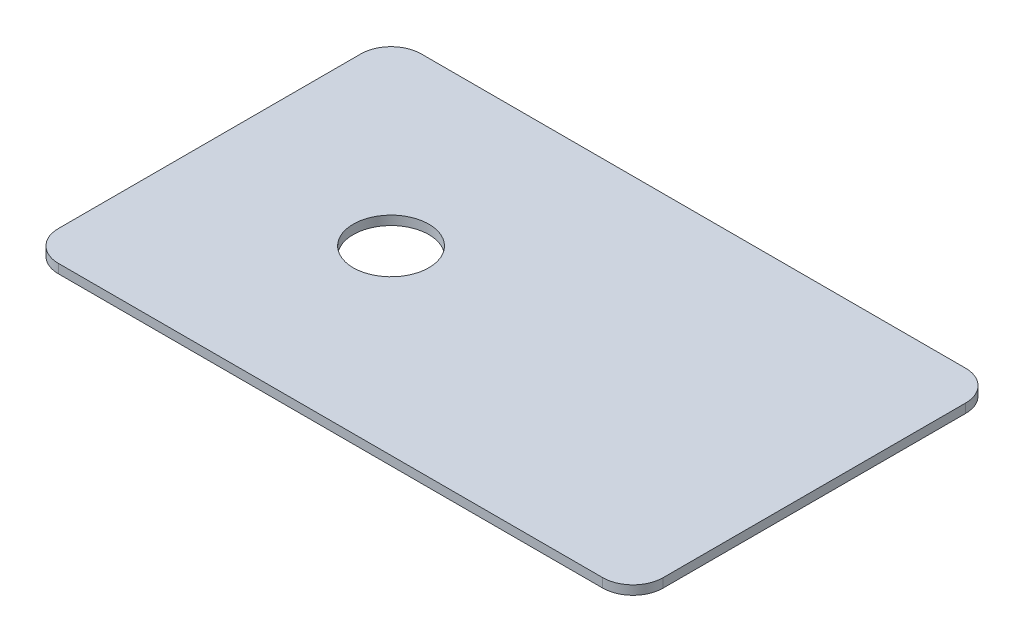
ISO-10303-21;
HEADER;
FILE_DESCRIPTION(('STEP AP214'),'2;1');
FILE_NAME('part.step','',(''),(''),'','','');
FILE_SCHEMA(('AUTOMOTIVE_DESIGN { 1 0 10303 214 1 1 1 1 }'));
ENDSEC;
DATA;
#1=APPLICATION_CONTEXT('core data for automotive mechanical design processes');
#2=APPLICATION_PROTOCOL_DEFINITION('international standard','automotive_design',2000,#1);
#3=PRODUCT_CONTEXT('',#1,'mechanical');
#4=PRODUCT('Part','Part','',(#3));
#5=PRODUCT_RELATED_PRODUCT_CATEGORY('part','',(#4));
#6=PRODUCT_DEFINITION_FORMATION('','',#4);
#7=PRODUCT_DEFINITION_CONTEXT('part definition',#1,'design');
#8=PRODUCT_DEFINITION('design','',#6,#7);
#9=PRODUCT_DEFINITION_SHAPE('','',#8);
#10=(LENGTH_UNIT() NAMED_UNIT(*) SI_UNIT(.MILLI.,.METRE.));
#11=(NAMED_UNIT(*) PLANE_ANGLE_UNIT() SI_UNIT($,.RADIAN.));
#12=(NAMED_UNIT(*) SI_UNIT($,.STERADIAN.) SOLID_ANGLE_UNIT());
#13=UNCERTAINTY_MEASURE_WITH_UNIT(LENGTH_MEASURE(1.E-05),#10,'distance_accuracy_value','');
#14=(GEOMETRIC_REPRESENTATION_CONTEXT(3) GLOBAL_UNCERTAINTY_ASSIGNED_CONTEXT((#13)) GLOBAL_UNIT_ASSIGNED_CONTEXT((#10,
#11,#12)) REPRESENTATION_CONTEXT('',''));
#15=CARTESIAN_POINT('',(0.,0.,0.));
#16=DIRECTION('',(0.,0.,1.));
#17=DIRECTION('',(1.,0.,0.));
#18=AXIS2_PLACEMENT_3D('',#15,#16,#17);
#19=CARTESIAN_POINT('',(-100.,3.,-60.));
#20=DIRECTION('',(1.,0.,0.));
#21=DIRECTION('',(0.,0.,-1.));
#22=AXIS2_PLACEMENT_3D('',#19,#20,#21);
#23=PLANE('',#22);
#24=DIRECTION('',(0.,0.,1.));
#25=VECTOR('',#24,1.);
#26=CARTESIAN_POINT('',(-100.,0.,-60.));
#27=LINE('',#26,#25);
#28=CARTESIAN_POINT('',(-100.,0.,-50.));
#29=VERTEX_POINT('',#28);
#30=CARTESIAN_POINT('',(-100.,0.,50.));
#31=VERTEX_POINT('',#30);
#32=EDGE_CURVE('E181',#29,#31,#27,.T.);
#33=ORIENTED_EDGE('',*,*,#32,.T.);
#34=DIRECTION('',(0.,-1.,0.));
#35=VECTOR('',#34,1.);
#36=CARTESIAN_POINT('',(-100.,3.,50.));
#37=LINE('',#36,#35);
#38=CARTESIAN_POINT('',(-100.,3.,50.));
#39=VERTEX_POINT('',#38);
#40=EDGE_CURVE('E166',#31,#39,#37,.F.);
#41=ORIENTED_EDGE('',*,*,#40,.T.);
#42=DIRECTION('',(0.,0.,1.));
#43=VECTOR('',#42,1.);
#44=CARTESIAN_POINT('',(-100.,3.,-60.));
#45=LINE('',#44,#43);
#46=CARTESIAN_POINT('',(-100.,3.,-50.));
#47=VERTEX_POINT('',#46);
#48=EDGE_CURVE('E183',#47,#39,#45,.T.);
#49=ORIENTED_EDGE('',*,*,#48,.F.);
#50=DIRECTION('',(0.,-1.,0.));
#51=VECTOR('',#50,1.);
#52=CARTESIAN_POINT('',(-100.,0.,-50.));
#53=LINE('',#52,#51);
#54=EDGE_CURVE('E162',#47,#29,#53,.T.);
#55=ORIENTED_EDGE('',*,*,#54,.T.);
#56=EDGE_LOOP('',(#33,#41,#49,#55));
#57=FACE_BOUND('',#56,.T.);
#58=ADVANCED_FACE('F38',(#57),#23,.F.);
#59=CARTESIAN_POINT('',(-100.,3.,60.));
#60=DIRECTION('',(0.,0.,-1.));
#61=DIRECTION('',(-1.,0.,0.));
#62=AXIS2_PLACEMENT_3D('',#59,#60,#61);
#63=PLANE('',#62);
#64=DIRECTION('',(1.,0.,0.));
#65=VECTOR('',#64,1.);
#66=CARTESIAN_POINT('',(-100.,0.,60.));
#67=LINE('',#66,#65);
#68=CARTESIAN_POINT('',(-90.,0.,60.));
#69=VERTEX_POINT('',#68);
#70=CARTESIAN_POINT('',(90.,0.,60.));
#71=VERTEX_POINT('',#70);
#72=EDGE_CURVE('E124',#69,#71,#67,.T.);
#73=ORIENTED_EDGE('',*,*,#72,.T.);
#74=DIRECTION('',(0.,-1.,0.));
#75=VECTOR('',#74,1.);
#76=CARTESIAN_POINT('',(90.,3.,60.));
#77=LINE('',#76,#75);
#78=CARTESIAN_POINT('',(90.,3.,60.));
#79=VERTEX_POINT('',#78);
#80=EDGE_CURVE('E148',#71,#79,#77,.F.);
#81=ORIENTED_EDGE('',*,*,#80,.T.);
#82=DIRECTION('',(1.,0.,0.));
#83=VECTOR('',#82,1.);
#84=CARTESIAN_POINT('',(-100.,3.,60.));
#85=LINE('',#84,#83);
#86=CARTESIAN_POINT('',(-90.,3.,60.));
#87=VERTEX_POINT('',#86);
#88=EDGE_CURVE('E198',#87,#79,#85,.T.);
#89=ORIENTED_EDGE('',*,*,#88,.F.);
#90=DIRECTION('',(0.,-1.,0.));
#91=VECTOR('',#90,1.);
#92=CARTESIAN_POINT('',(-90.,3.,60.));
#93=LINE('',#92,#91);
#94=EDGE_CURVE('E144',#87,#69,#93,.T.);
#95=ORIENTED_EDGE('',*,*,#94,.T.);
#96=EDGE_LOOP('',(#73,#81,#89,#95));
#97=FACE_BOUND('',#96,.T.);
#98=ADVANCED_FACE('F220',(#97),#63,.F.);
#99=CARTESIAN_POINT('',(100.,3.,-60.));
#100=DIRECTION('',(1.,0.,0.));
#101=DIRECTION('',(0.,0.,-1.));
#102=AXIS2_PLACEMENT_3D('',#99,#100,#101);
#103=PLANE('',#102);
#104=DIRECTION('',(0.,0.,1.));
#105=VECTOR('',#104,1.);
#106=CARTESIAN_POINT('',(100.,3.,-60.));
#107=LINE('',#106,#105);
#108=CARTESIAN_POINT('',(100.,3.,-50.));
#109=VERTEX_POINT('',#108);
#110=CARTESIAN_POINT('',(100.,3.,50.));
#111=VERTEX_POINT('',#110);
#112=EDGE_CURVE('E132',#109,#111,#107,.T.);
#113=ORIENTED_EDGE('',*,*,#112,.T.);
#114=DIRECTION('',(0.,-1.,0.));
#115=VECTOR('',#114,1.);
#116=CARTESIAN_POINT('',(100.,0.,50.));
#117=LINE('',#116,#115);
#118=CARTESIAN_POINT('',(100.,0.,50.));
#119=VERTEX_POINT('',#118);
#120=EDGE_CURVE('E115',#111,#119,#117,.T.);
#121=ORIENTED_EDGE('',*,*,#120,.T.);
#122=DIRECTION('',(0.,0.,1.));
#123=VECTOR('',#122,1.);
#124=CARTESIAN_POINT('',(100.,0.,-60.));
#125=LINE('',#124,#123);
#126=CARTESIAN_POINT('',(100.,0.,-50.));
#127=VERTEX_POINT('',#126);
#128=EDGE_CURVE('E107',#127,#119,#125,.T.);
#129=ORIENTED_EDGE('',*,*,#128,.F.);
#130=DIRECTION('',(0.,-1.,0.));
#131=VECTOR('',#130,1.);
#132=CARTESIAN_POINT('',(100.,3.,-50.));
#133=LINE('',#132,#131);
#134=EDGE_CURVE('E121',#127,#109,#133,.F.);
#135=ORIENTED_EDGE('',*,*,#134,.T.);
#136=EDGE_LOOP('',(#113,#121,#129,#135));
#137=FACE_BOUND('',#136,.T.);
#138=ADVANCED_FACE('F120',(#137),#103,.T.);
#139=CARTESIAN_POINT('',(-100.,3.,-60.));
#140=DIRECTION('',(0.,0.,-1.));
#141=DIRECTION('',(-1.,0.,0.));
#142=AXIS2_PLACEMENT_3D('',#139,#140,#141);
#143=PLANE('',#142);
#144=DIRECTION('',(1.,0.,0.));
#145=VECTOR('',#144,1.);
#146=CARTESIAN_POINT('',(-100.,0.,-60.));
#147=LINE('',#146,#145);
#148=CARTESIAN_POINT('',(-90.,0.,-60.));
#149=VERTEX_POINT('',#148);
#150=CARTESIAN_POINT('',(90.,0.,-60.));
#151=VERTEX_POINT('',#150);
#152=EDGE_CURVE('E108',#149,#151,#147,.T.);
#153=ORIENTED_EDGE('',*,*,#152,.F.);
#154=DIRECTION('',(0.,-1.,0.));
#155=VECTOR('',#154,1.);
#156=CARTESIAN_POINT('',(-90.,3.,-60.));
#157=LINE('',#156,#155);
#158=CARTESIAN_POINT('',(-90.,3.,-60.));
#159=VERTEX_POINT('',#158);
#160=EDGE_CURVE('E11',#149,#159,#157,.F.);
#161=ORIENTED_EDGE('',*,*,#160,.T.);
#162=DIRECTION('',(1.,0.,0.));
#163=VECTOR('',#162,1.);
#164=CARTESIAN_POINT('',(-100.,3.,-60.));
#165=LINE('',#164,#163);
#166=CARTESIAN_POINT('',(90.,3.,-60.));
#167=VERTEX_POINT('',#166);
#168=EDGE_CURVE('E127',#159,#167,#165,.T.);
#169=ORIENTED_EDGE('',*,*,#168,.T.);
#170=DIRECTION('',(0.,-1.,0.));
#171=VECTOR('',#170,1.);
#172=CARTESIAN_POINT('',(90.,3.,-60.));
#173=LINE('',#172,#171);
#174=EDGE_CURVE('E47',#167,#151,#173,.T.);
#175=ORIENTED_EDGE('',*,*,#174,.T.);
#176=EDGE_LOOP('',(#153,#161,#169,#175));
#177=FACE_BOUND('',#176,.T.);
#178=ADVANCED_FACE('F169',(#177),#143,.T.);
#179=CARTESIAN_POINT('',(0.,3.,0.));
#180=DIRECTION('',(0.,1.,0.));
#181=DIRECTION('',(0.,0.,1.));
#182=AXIS2_PLACEMENT_3D('',#179,#180,#181);
#183=PLANE('',#182);
#184=CARTESIAN_POINT('',(-40.,3.,0.));
#185=DIRECTION('',(0.,1.,0.));
#186=DIRECTION('',(0.,0.,1.));
#187=AXIS2_PLACEMENT_3D('',#184,#185,#186);
#188=CIRCLE('',#187,12.5);
#189=CARTESIAN_POINT('',(-40.,3.,12.5));
#190=VERTEX_POINT('',#189);
#191=EDGE_CURVE('E193',#190,#190,#188,.T.);
#192=ORIENTED_EDGE('',*,*,#191,.F.);
#193=EDGE_LOOP('',(#192));
#194=FACE_BOUND('',#193,.T.);
#195=ORIENTED_EDGE('',*,*,#88,.T.);
#196=CARTESIAN_POINT('',(90.,3.,50.));
#197=DIRECTION('',(0.,1.,0.));
#198=DIRECTION('',(0.,0.,1.));
#199=AXIS2_PLACEMENT_3D('',#196,#197,#198);
#200=CIRCLE('',#199,10.);
#201=EDGE_CURVE('E159',#79,#111,#200,.T.);
#202=ORIENTED_EDGE('',*,*,#201,.T.);
#203=ORIENTED_EDGE('',*,*,#112,.F.);
#204=CARTESIAN_POINT('',(90.,3.,-50.));
#205=DIRECTION('',(0.,1.,0.));
#206=DIRECTION('',(0.,0.,1.));
#207=AXIS2_PLACEMENT_3D('',#204,#205,#206);
#208=CIRCLE('',#207,10.);
#209=EDGE_CURVE('E54',#109,#167,#208,.T.);
#210=ORIENTED_EDGE('',*,*,#209,.T.);
#211=ORIENTED_EDGE('',*,*,#168,.F.);
#212=CARTESIAN_POINT('',(-90.,3.,-50.));
#213=DIRECTION('',(0.,1.,0.));
#214=DIRECTION('',(0.,0.,1.));
#215=AXIS2_PLACEMENT_3D('',#212,#213,#214);
#216=CIRCLE('',#215,10.);
#217=EDGE_CURVE('E153',#159,#47,#216,.T.);
#218=ORIENTED_EDGE('',*,*,#217,.T.);
#219=ORIENTED_EDGE('',*,*,#48,.T.);
#220=CARTESIAN_POINT('',(-90.,3.,50.));
#221=DIRECTION('',(0.,1.,0.));
#222=DIRECTION('',(0.,0.,1.));
#223=AXIS2_PLACEMENT_3D('',#220,#221,#222);
#224=CIRCLE('',#223,10.);
#225=EDGE_CURVE('E156',#39,#87,#224,.T.);
#226=ORIENTED_EDGE('',*,*,#225,.T.);
#227=EDGE_LOOP('',(#195,#202,#203,#210,#211,#218,#219,#226));
#228=FACE_BOUND('',#227,.T.);
#229=ADVANCED_FACE('F172',(#194,#228),#183,.T.);
#230=CARTESIAN_POINT('',(0.,0.,0.));
#231=DIRECTION('',(0.,1.,0.));
#232=DIRECTION('',(0.,0.,1.));
#233=AXIS2_PLACEMENT_3D('',#230,#231,#232);
#234=PLANE('',#233);
#235=CARTESIAN_POINT('',(-40.,0.,0.));
#236=DIRECTION('',(0.,1.,0.));
#237=DIRECTION('',(0.,0.,1.));
#238=AXIS2_PLACEMENT_3D('',#235,#236,#237);
#239=CIRCLE('',#238,12.5);
#240=CARTESIAN_POINT('',(-40.,0.,12.5));
#241=VERTEX_POINT('',#240);
#242=EDGE_CURVE('E186',#241,#241,#239,.T.);
#243=ORIENTED_EDGE('',*,*,#242,.T.);
#244=EDGE_LOOP('',(#243));
#245=FACE_BOUND('',#244,.T.);
#246=ORIENTED_EDGE('',*,*,#128,.T.);
#247=CARTESIAN_POINT('',(90.,0.,50.));
#248=DIRECTION('',(0.,1.,0.));
#249=DIRECTION('',(0.,0.,1.));
#250=AXIS2_PLACEMENT_3D('',#247,#248,#249);
#251=CIRCLE('',#250,10.);
#252=EDGE_CURVE('E141',#119,#71,#251,.F.);
#253=ORIENTED_EDGE('',*,*,#252,.T.);
#254=ORIENTED_EDGE('',*,*,#72,.F.);
#255=CARTESIAN_POINT('',(-90.,0.,50.));
#256=DIRECTION('',(0.,1.,0.));
#257=DIRECTION('',(0.,0.,1.));
#258=AXIS2_PLACEMENT_3D('',#255,#256,#257);
#259=CIRCLE('',#258,10.);
#260=EDGE_CURVE('E138',#69,#31,#259,.F.);
#261=ORIENTED_EDGE('',*,*,#260,.T.);
#262=ORIENTED_EDGE('',*,*,#32,.F.);
#263=CARTESIAN_POINT('',(-90.,0.,-50.));
#264=DIRECTION('',(0.,1.,0.));
#265=DIRECTION('',(0.,0.,1.));
#266=AXIS2_PLACEMENT_3D('',#263,#264,#265);
#267=CIRCLE('',#266,10.);
#268=EDGE_CURVE('E114',#29,#149,#267,.F.);
#269=ORIENTED_EDGE('',*,*,#268,.T.);
#270=ORIENTED_EDGE('',*,*,#152,.T.);
#271=CARTESIAN_POINT('',(90.,0.,-50.));
#272=DIRECTION('',(0.,1.,0.));
#273=DIRECTION('',(0.,0.,1.));
#274=AXIS2_PLACEMENT_3D('',#271,#272,#273);
#275=CIRCLE('',#274,10.);
#276=EDGE_CURVE('E104',#151,#127,#275,.F.);
#277=ORIENTED_EDGE('',*,*,#276,.T.);
#278=EDGE_LOOP('',(#246,#253,#254,#261,#262,#269,#270,#277));
#279=FACE_BOUND('',#278,.T.);
#280=ADVANCED_FACE('F106',(#245,#279),#234,.F.);
#281=CARTESIAN_POINT('',(-40.,0.,0.));
#282=DIRECTION('',(0.,1.,0.));
#283=DIRECTION('',(0.,0.,1.));
#284=AXIS2_PLACEMENT_3D('',#281,#282,#283);
#285=CYLINDRICAL_SURFACE('',#284,12.5);
#286=ORIENTED_EDGE('',*,*,#242,.F.);
#287=EDGE_LOOP('',(#286));
#288=FACE_BOUND('',#287,.T.);
#289=ORIENTED_EDGE('',*,*,#191,.T.);
#290=EDGE_LOOP('',(#289));
#291=FACE_BOUND('',#290,.T.);
#292=ADVANCED_FACE('F207',(#288,#291),#285,.F.);
#293=CARTESIAN_POINT('',(90.,3.,50.));
#294=DIRECTION('',(0.,1.,0.));
#295=DIRECTION('',(0.,0.,1.));
#296=AXIS2_PLACEMENT_3D('',#293,#294,#295);
#297=CYLINDRICAL_SURFACE('',#296,10.);
#298=ORIENTED_EDGE('',*,*,#201,.F.);
#299=ORIENTED_EDGE('',*,*,#80,.F.);
#300=ORIENTED_EDGE('',*,*,#252,.F.);
#301=ORIENTED_EDGE('',*,*,#120,.F.);
#302=EDGE_LOOP('',(#298,#299,#300,#301));
#303=FACE_BOUND('',#302,.T.);
#304=ADVANCED_FACE('F230',(#303),#297,.T.);
#305=CARTESIAN_POINT('',(-90.,3.,50.));
#306=DIRECTION('',(0.,-1.,0.));
#307=DIRECTION('',(0.,0.,-1.));
#308=AXIS2_PLACEMENT_3D('',#305,#306,#307);
#309=CYLINDRICAL_SURFACE('',#308,10.);
#310=ORIENTED_EDGE('',*,*,#225,.F.);
#311=ORIENTED_EDGE('',*,*,#40,.F.);
#312=ORIENTED_EDGE('',*,*,#260,.F.);
#313=ORIENTED_EDGE('',*,*,#94,.F.);
#314=EDGE_LOOP('',(#310,#311,#312,#313));
#315=FACE_BOUND('',#314,.T.);
#316=ADVANCED_FACE('F233',(#315),#309,.T.);
#317=CARTESIAN_POINT('',(-90.,3.,-50.));
#318=DIRECTION('',(0.,1.,0.));
#319=DIRECTION('',(0.,0.,1.));
#320=AXIS2_PLACEMENT_3D('',#317,#318,#319);
#321=CYLINDRICAL_SURFACE('',#320,10.);
#322=ORIENTED_EDGE('',*,*,#217,.F.);
#323=ORIENTED_EDGE('',*,*,#160,.F.);
#324=ORIENTED_EDGE('',*,*,#268,.F.);
#325=ORIENTED_EDGE('',*,*,#54,.F.);
#326=EDGE_LOOP('',(#322,#323,#324,#325));
#327=FACE_BOUND('',#326,.T.);
#328=ADVANCED_FACE('F177',(#327),#321,.T.);
#329=CARTESIAN_POINT('',(90.,3.,-50.));
#330=DIRECTION('',(0.,-1.,0.));
#331=DIRECTION('',(0.,0.,-1.));
#332=AXIS2_PLACEMENT_3D('',#329,#330,#331);
#333=CYLINDRICAL_SURFACE('',#332,10.);
#334=ORIENTED_EDGE('',*,*,#209,.F.);
#335=ORIENTED_EDGE('',*,*,#134,.F.);
#336=ORIENTED_EDGE('',*,*,#276,.F.);
#337=ORIENTED_EDGE('',*,*,#174,.F.);
#338=EDGE_LOOP('',(#334,#335,#336,#337));
#339=FACE_BOUND('',#338,.T.);
#340=ADVANCED_FACE('F40',(#339),#333,.T.);
#341=CLOSED_SHELL('',(#58,#98,#138,#178,#229,#280,#292,#304,#316,#328,#340));
#342=MANIFOLD_SOLID_BREP('B2',#341);
#343=ADVANCED_BREP_SHAPE_REPRESENTATION('',(#18,#342),#14);
#344=SHAPE_DEFINITION_REPRESENTATION(#9,#343);
ENDSEC;
END-ISO-10303-21;
